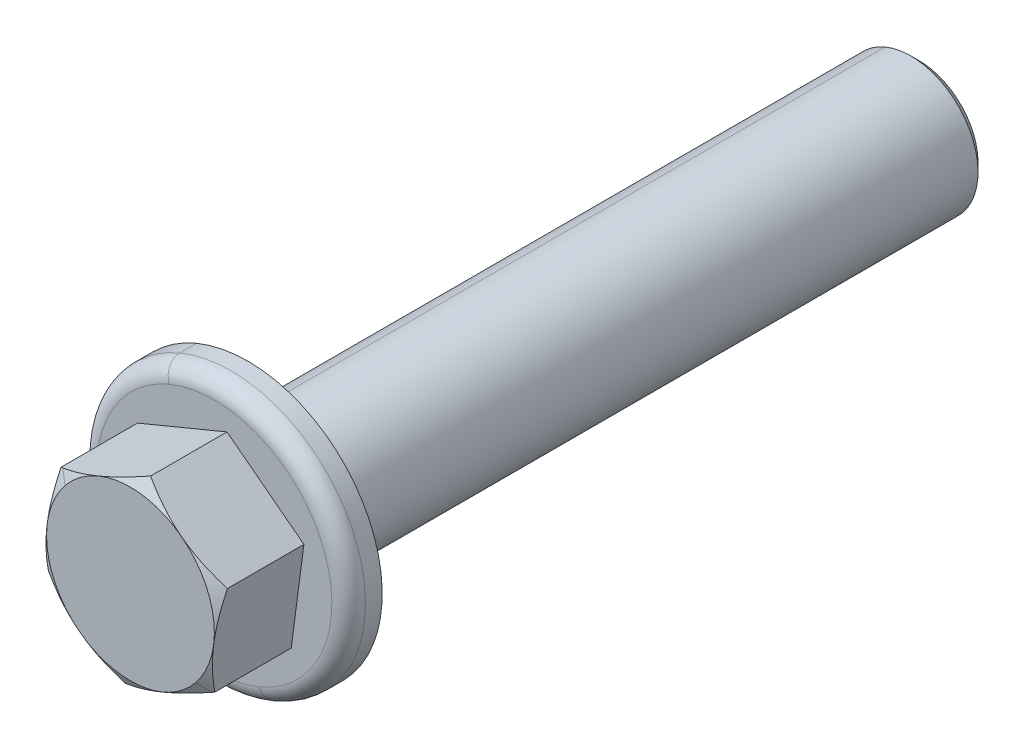
ISO-10303-21;
HEADER;
FILE_DESCRIPTION(('STEP AP214'),'2;1');
FILE_NAME('part.step','',(''),(''),'','','');
FILE_SCHEMA(('AUTOMOTIVE_DESIGN { 1 0 10303 214 1 1 1 1 }'));
ENDSEC;
DATA;
#1=APPLICATION_CONTEXT('core data for automotive mechanical design processes');
#2=APPLICATION_PROTOCOL_DEFINITION('international standard','automotive_design',2000,#1);
#3=PRODUCT_CONTEXT('',#1,'mechanical');
#4=PRODUCT('Part','Part','',(#3));
#5=PRODUCT_RELATED_PRODUCT_CATEGORY('part','',(#4));
#6=PRODUCT_DEFINITION_FORMATION('','',#4);
#7=PRODUCT_DEFINITION_CONTEXT('part definition',#1,'design');
#8=PRODUCT_DEFINITION('design','',#6,#7);
#9=PRODUCT_DEFINITION_SHAPE('','',#8);
#10=(LENGTH_UNIT() NAMED_UNIT(*) SI_UNIT(.MILLI.,.METRE.));
#11=(NAMED_UNIT(*) PLANE_ANGLE_UNIT() SI_UNIT($,.RADIAN.));
#12=(NAMED_UNIT(*) SI_UNIT($,.STERADIAN.) SOLID_ANGLE_UNIT());
#13=UNCERTAINTY_MEASURE_WITH_UNIT(LENGTH_MEASURE(1.E-05),#10,'distance_accuracy_value','');
#14=(GEOMETRIC_REPRESENTATION_CONTEXT(3) GLOBAL_UNCERTAINTY_ASSIGNED_CONTEXT((#13)) GLOBAL_UNIT_ASSIGNED_CONTEXT((#10,
#11,#12)) REPRESENTATION_CONTEXT('',''));
#15=CARTESIAN_POINT('',(0.,0.,0.));
#16=DIRECTION('',(0.,0.,1.));
#17=DIRECTION('',(1.,0.,0.));
#18=AXIS2_PLACEMENT_3D('',#15,#16,#17);
#19=CARTESIAN_POINT('',(75.,-122.,24.3));
#20=DIRECTION('',(0.,0.,1.));
#21=DIRECTION('',(0.923728021347068,0.383049008063238,0.));
#22=AXIS2_PLACEMENT_3D('',#19,#20,#21);
#23=TOROIDAL_SURFACE('',#22,4.25,0.25);
#24=CARTESIAN_POINT('',(75.,-122.,24.55));
#25=DIRECTION('',(0.,0.,-1.));
#26=DIRECTION('',(-0.923728021347068,-0.383049008063239,0.));
#27=AXIS2_PLACEMENT_3D('',#24,#25,#26);
#28=CIRCLE('',#27,4.25);
#29=CARTESIAN_POINT('',(76.6279582842688,-125.925844090725,24.55));
#30=VERTEX_POINT('',#29);
#31=CARTESIAN_POINT('',(73.3720417157312,-118.074155909275,24.55));
#32=VERTEX_POINT('',#31);
#33=EDGE_CURVE('E11',#30,#32,#28,.T.);
#34=ORIENTED_EDGE('',*,*,#33,.T.);
#35=CARTESIAN_POINT('',(73.3720417157312,-118.074155909275,24.3));
#36=DIRECTION('',(0.923728021347068,0.383049008063238,0.));
#37=DIRECTION('',(0.,0.,1.));
#38=AXIS2_PLACEMENT_3D('',#35,#36,#37);
#39=CIRCLE('',#38,0.25);
#40=CARTESIAN_POINT('',(73.4678039677471,-118.305087914612,24.3));
#41=VERTEX_POINT('',#40);
#42=EDGE_CURVE('E33',#32,#41,#39,.T.);
#43=ORIENTED_EDGE('',*,*,#42,.T.);
#44=CARTESIAN_POINT('',(75.,-122.,24.3));
#45=DIRECTION('',(0.,0.,-1.));
#46=DIRECTION('',(-0.923728021347069,-0.383049008063237,0.));
#47=AXIS2_PLACEMENT_3D('',#44,#45,#46);
#48=CIRCLE('',#47,4.);
#49=CARTESIAN_POINT('',(76.532196032253,-125.694912085388,24.3));
#50=VERTEX_POINT('',#49);
#51=EDGE_CURVE('E461',#50,#41,#48,.T.);
#52=ORIENTED_EDGE('',*,*,#51,.F.);
#53=CARTESIAN_POINT('',(76.6279582842688,-125.925844090725,24.3));
#54=DIRECTION('',(-0.923728021347068,-0.383049008063238,0.));
#55=DIRECTION('',(0.,0.,1.));
#56=AXIS2_PLACEMENT_3D('',#53,#54,#55);
#57=CIRCLE('',#56,0.25);
#58=EDGE_CURVE('E457',#30,#50,#57,.T.);
#59=ORIENTED_EDGE('',*,*,#58,.F.);
#60=EDGE_LOOP('',(#34,#43,#52,#59));
#61=FACE_BOUND('',#60,.T.);
#62=ADVANCED_FACE('F17',(#61),#23,.F.);
#63=CARTESIAN_POINT('',(75.,-122.,24.3));
#64=DIRECTION('',(0.,0.,1.));
#65=DIRECTION('',(-0.383049008063239,0.923728021347068,0.));
#66=AXIS2_PLACEMENT_3D('',#63,#64,#65);
#67=TOROIDAL_SURFACE('',#66,4.25,0.25);
#68=CARTESIAN_POINT('',(75.,-122.,24.55));
#69=DIRECTION('',(0.,0.,-1.));
#70=DIRECTION('',(-0.923728021347068,-0.383049008063239,0.));
#71=AXIS2_PLACEMENT_3D('',#68,#69,#70);
#72=CIRCLE('',#71,4.25);
#73=EDGE_CURVE('E454',#32,#30,#72,.T.);
#74=ORIENTED_EDGE('',*,*,#73,.T.);
#75=ORIENTED_EDGE('',*,*,#58,.T.);
#76=CARTESIAN_POINT('',(75.,-122.,24.3));
#77=DIRECTION('',(0.,0.,-1.));
#78=DIRECTION('',(-0.923728021347069,-0.383049008063237,0.));
#79=AXIS2_PLACEMENT_3D('',#76,#77,#78);
#80=CIRCLE('',#79,4.);
#81=EDGE_CURVE('E465',#41,#50,#80,.T.);
#82=ORIENTED_EDGE('',*,*,#81,.F.);
#83=ORIENTED_EDGE('',*,*,#42,.F.);
#84=EDGE_LOOP('',(#74,#75,#82,#83));
#85=FACE_BOUND('',#84,.T.);
#86=ADVANCED_FACE('F311',(#85),#67,.F.);
#87=CARTESIAN_POINT('',(75.,-122.,4.55));
#88=DIRECTION('',(0.,0.,1.));
#89=DIRECTION('',(0.923728021347069,0.383049008063237,0.));
#90=AXIS2_PLACEMENT_3D('',#87,#88,#89);
#91=CYLINDRICAL_SURFACE('',#90,4.);
#92=DIRECTION('',(0.,0.,-1.));
#93=VECTOR('',#92,1.);
#94=CARTESIAN_POINT('',(76.532196032253,-125.694912085388,4.55));
#95=LINE('',#94,#93);
#96=CARTESIAN_POINT('',(76.532196032253,-125.694912085388,-14.95));
#97=VERTEX_POINT('',#96);
#98=EDGE_CURVE('E468',#50,#97,#95,.T.);
#99=ORIENTED_EDGE('',*,*,#98,.F.);
#100=ORIENTED_EDGE('',*,*,#51,.T.);
#101=DIRECTION('',(0.,0.,-1.));
#102=VECTOR('',#101,1.);
#103=CARTESIAN_POINT('',(73.4678039677471,-118.305087914612,4.55));
#104=LINE('',#103,#102);
#105=CARTESIAN_POINT('',(73.4678039677471,-118.305087914612,-14.95));
#106=VERTEX_POINT('',#105);
#107=EDGE_CURVE('E472',#41,#106,#104,.T.);
#108=ORIENTED_EDGE('',*,*,#107,.T.);
#109=CARTESIAN_POINT('',(75.,-122.,-14.95));
#110=DIRECTION('',(0.,0.,1.));
#111=DIRECTION('',(-0.923728021347069,-0.383049008063237,0.));
#112=AXIS2_PLACEMENT_3D('',#109,#110,#111);
#113=CIRCLE('',#112,4.);
#114=EDGE_CURVE('E467',#106,#97,#113,.T.);
#115=ORIENTED_EDGE('',*,*,#114,.T.);
#116=EDGE_LOOP('',(#99,#100,#108,#115));
#117=FACE_BOUND('',#116,.T.);
#118=ADVANCED_FACE('F317',(#117),#91,.T.);
#119=CARTESIAN_POINT('',(75.,-122.,4.55));
#120=DIRECTION('',(0.,0.,1.));
#121=DIRECTION('',(0.923728021347069,0.383049008063237,0.));
#122=AXIS2_PLACEMENT_3D('',#119,#120,#121);
#123=CYLINDRICAL_SURFACE('',#122,4.);
#124=ORIENTED_EDGE('',*,*,#107,.F.);
#125=ORIENTED_EDGE('',*,*,#81,.T.);
#126=ORIENTED_EDGE('',*,*,#98,.T.);
#127=CARTESIAN_POINT('',(75.,-122.,-14.95));
#128=DIRECTION('',(0.,0.,1.));
#129=DIRECTION('',(-0.923728021347069,-0.383049008063237,0.));
#130=AXIS2_PLACEMENT_3D('',#127,#128,#129);
#131=CIRCLE('',#130,4.);
#132=EDGE_CURVE('E471',#97,#106,#131,.T.);
#133=ORIENTED_EDGE('',*,*,#132,.T.);
#134=EDGE_LOOP('',(#124,#125,#126,#133));
#135=FACE_BOUND('',#134,.T.);
#136=ADVANCED_FACE('F322',(#135),#123,.T.);
#137=CARTESIAN_POINT('',(75.,-122.,-18.95));
#138=DIRECTION('',(0.,0.,1.));
#139=DIRECTION('',(-0.114958388351689,0.993370308066223,0.));
#140=AXIS2_PLACEMENT_3D('',#137,#138,#139);
#141=CONICAL_SURFACE('',#140,0.,0.785398163396999);
#142=DIRECTION('',(0.270856393052956,-0.653174413416782,-0.707106781186537));
#143=VECTOR('',#142,1.);
#144=CARTESIAN_POINT('',(73.563567058084,-118.536019572316,-15.2));
#145=LINE('',#144,#143);
#146=CARTESIAN_POINT('',(73.659328713789,-118.766951824929,-15.45));
#147=VERTEX_POINT('',#146);
#148=EDGE_CURVE('E478',#106,#147,#145,.T.);
#149=ORIENTED_EDGE('',*,*,#148,.T.);
#150=CARTESIAN_POINT('',(75.,-122.,-15.45));
#151=DIRECTION('',(0.,0.,1.));
#152=DIRECTION('',(0.993370308066189,0.114958388351984,0.));
#153=AXIS2_PLACEMENT_3D('',#150,#151,#152);
#154=CIRCLE('',#153,3.5);
#155=CARTESIAN_POINT('',(76.3406715282213,-125.233048074715,-15.45));
#156=VERTEX_POINT('',#155);
#157=EDGE_CURVE('E481',#147,#156,#154,.T.);
#158=ORIENTED_EDGE('',*,*,#157,.T.);
#159=DIRECTION('',(-0.270856551128283,0.65317434786655,-0.707106781186547));
#160=VECTOR('',#159,1.);
#161=CARTESIAN_POINT('',(76.4364337802371,-125.463980080051,-15.2));
#162=LINE('',#161,#160);
#163=EDGE_CURVE('E484',#97,#156,#162,.T.);
#164=ORIENTED_EDGE('',*,*,#163,.F.);
#165=ORIENTED_EDGE('',*,*,#114,.F.);
#166=EDGE_LOOP('',(#149,#158,#164,#165));
#167=FACE_BOUND('',#166,.T.);
#168=ADVANCED_FACE('F326',(#167),#141,.T.);
#169=CARTESIAN_POINT('',(75.,-122.,-18.95));
#170=DIRECTION('',(-2.07112037355488E-13,-2.99341000002082E-13,1.));
#171=DIRECTION('',(0.383049008063238,-0.923728021347068,-1.97175609173E-13));
#172=AXIS2_PLACEMENT_3D('',#169,#170,#171);
#173=CONICAL_SURFACE('',#172,0.,0.785398163396999);
#174=ORIENTED_EDGE('',*,*,#163,.T.);
#175=CARTESIAN_POINT('',(75.,-122.,-15.4499999999993));
#176=DIRECTION('',(-2.8263995886347E-13,-1.17204364682804E-13,1.));
#177=DIRECTION('',(0.923728021347068,0.383049008063237,3.05977465587E-13));
#178=AXIS2_PLACEMENT_3D('',#175,#176,#177);
#179=CIRCLE('',#178,3.5);
#180=EDGE_CURVE('E352',#156,#147,#179,.T.);
#181=ORIENTED_EDGE('',*,*,#180,.T.);
#182=ORIENTED_EDGE('',*,*,#148,.F.);
#183=ORIENTED_EDGE('',*,*,#132,.F.);
#184=EDGE_LOOP('',(#174,#181,#182,#183));
#185=FACE_BOUND('',#184,.T.);
#186=ADVANCED_FACE('F330',(#185),#173,.T.);
#187=CARTESIAN_POINT('',(75.,-122.,-15.45));
#188=DIRECTION('',(0.,0.,1.));
#189=DIRECTION('',(-0.383049008063238,0.923728021347068,0.));
#190=AXIS2_PLACEMENT_3D('',#187,#188,#189);
#191=PLANE('',#190);
#192=ORIENTED_EDGE('',*,*,#180,.F.);
#193=ORIENTED_EDGE('',*,*,#157,.F.);
#194=EDGE_LOOP('',(#192,#193));
#195=FACE_BOUND('',#194,.T.);
#196=ADVANCED_FACE('F334',(#195),#191,.F.);
#197=CARTESIAN_POINT('',(75.,-122.,31.55));
#198=DIRECTION('',(0.,0.,1.));
#199=DIRECTION('',(0.923728021347068,0.383049008063238,0.));
#200=AXIS2_PLACEMENT_3D('',#197,#198,#199);
#201=PLANE('',#200);
#202=CARTESIAN_POINT('',(75.,-122.,31.55));
#203=DIRECTION('',(0.,0.,1.));
#204=DIRECTION('',(-0.923728021347068,-0.383049008063239,0.));
#205=AXIS2_PLACEMENT_3D('',#202,#203,#204);
#206=CIRCLE('',#205,5.);
#207=CARTESIAN_POINT('',(79.9574821835296,-122.650669193983,31.5499999999994));
#208=VERTEX_POINT('',#207);
#209=CARTESIAN_POINT('',(78.0422371432125,-118.032029087245,31.5499999999992));
#210=VERTEX_POINT('',#209);
#211=EDGE_CURVE('E347',#208,#210,#206,.T.);
#212=ORIENTED_EDGE('',*,*,#211,.T.);
#213=CARTESIAN_POINT('',(75.,-122.,31.55));
#214=DIRECTION('',(0.,0.,1.));
#215=DIRECTION('',(-0.923728021347068,-0.383049008063239,0.));
#216=AXIS2_PLACEMENT_3D('',#213,#214,#215);
#217=CIRCLE('',#216,5.);
#218=CARTESIAN_POINT('',(73.0847549596836,-117.381359893265,31.55));
#219=VERTEX_POINT('',#218);
#220=EDGE_CURVE('E353',#210,#219,#217,.T.);
#221=ORIENTED_EDGE('',*,*,#220,.T.);
#222=CARTESIAN_POINT('',(75.,-122.,31.55));
#223=DIRECTION('',(0.,0.,1.));
#224=DIRECTION('',(-0.923728021347068,-0.383049008063239,0.));
#225=AXIS2_PLACEMENT_3D('',#222,#223,#224);
#226=CIRCLE('',#225,5.);
#227=CARTESIAN_POINT('',(71.1049203300826,-118.864979367695,31.55));
#228=VERTEX_POINT('',#227);
#229=EDGE_CURVE('E368',#219,#228,#226,.T.);
#230=ORIENTED_EDGE('',*,*,#229,.T.);
#231=CARTESIAN_POINT('',(75.,-122.,31.55));
#232=DIRECTION('',(0.,0.,1.));
#233=DIRECTION('',(-0.923728021347068,-0.383049008063239,0.));
#234=AXIS2_PLACEMENT_3D('',#231,#232,#233);
#235=CIRCLE('',#234,5.);
#236=CARTESIAN_POINT('',(70.0425178164705,-121.349330806017,31.5499999999994));
#237=VERTEX_POINT('',#236);
#238=EDGE_CURVE('E372',#228,#237,#235,.T.);
#239=ORIENTED_EDGE('',*,*,#238,.T.);
#240=CARTESIAN_POINT('',(75.,-122.,31.55));
#241=DIRECTION('',(0.,0.,1.));
#242=DIRECTION('',(-0.923728021347068,-0.383049008063239,0.));
#243=AXIS2_PLACEMENT_3D('',#240,#241,#242);
#244=CIRCLE('',#243,5.);
#245=CARTESIAN_POINT('',(71.9577628567875,-125.967970912755,31.5499999999992));
#246=VERTEX_POINT('',#245);
#247=EDGE_CURVE('E172',#237,#246,#244,.T.);
#248=ORIENTED_EDGE('',*,*,#247,.T.);
#249=CARTESIAN_POINT('',(75.,-122.,31.55));
#250=DIRECTION('',(0.,0.,1.));
#251=DIRECTION('',(-0.923728021347068,-0.383049008063239,0.));
#252=AXIS2_PLACEMENT_3D('',#249,#250,#251);
#253=CIRCLE('',#252,5.);
#254=CARTESIAN_POINT('',(76.9152450403164,-126.618640106735,31.55));
#255=VERTEX_POINT('',#254);
#256=EDGE_CURVE('E147',#246,#255,#253,.T.);
#257=ORIENTED_EDGE('',*,*,#256,.T.);
#258=CARTESIAN_POINT('',(75.,-122.,31.55));
#259=DIRECTION('',(0.,0.,1.));
#260=DIRECTION('',(-0.923728021347068,-0.383049008063239,0.));
#261=AXIS2_PLACEMENT_3D('',#258,#259,#260);
#262=CIRCLE('',#261,5.);
#263=CARTESIAN_POINT('',(78.8950796699174,-125.135020632304,31.55));
#264=VERTEX_POINT('',#263);
#265=EDGE_CURVE('E160',#255,#264,#262,.T.);
#266=ORIENTED_EDGE('',*,*,#265,.T.);
#267=CARTESIAN_POINT('',(75.,-122.,31.55));
#268=DIRECTION('',(0.,0.,1.));
#269=DIRECTION('',(-0.923728021347068,-0.383049008063239,0.));
#270=AXIS2_PLACEMENT_3D('',#267,#268,#269);
#271=CIRCLE('',#270,5.);
#272=EDGE_CURVE('E166',#264,#208,#271,.T.);
#273=ORIENTED_EDGE('',*,*,#272,.T.);
#274=EDGE_LOOP('',(#212,#221,#230,#239,#248,#257,#266,#273));
#275=FACE_BOUND('',#274,.T.);
#276=ADVANCED_FACE('F169',(#275),#201,.T.);
#277=CARTESIAN_POINT('',(75.,-122.,31.55));
#278=DIRECTION('',(0.,0.,-1.));
#279=DIRECTION('',(0.779015933983816,-0.62700412646116,0.));
#280=AXIS2_PLACEMENT_3D('',#277,#278,#279);
#281=CONICAL_SURFACE('',#280,5.,1.0471975512);
#282=ORIENTED_EDGE('',*,*,#211,.F.);
#283=CARTESIAN_POINT('',(80.3331462178307,-119.788465520815,31.1034180126158));
#284=CARTESIAN_POINT('',(80.3025673254997,-120.021447680298,31.1712680083952));
#285=CARTESIAN_POINT('',(80.2717435464103,-120.256295644637,31.2334304503108));
#286=CARTESIAN_POINT('',(80.2098242796661,-120.728061734902,31.3430527974049));
#287=CARTESIAN_POINT('',(80.1787309518113,-120.964963405202,31.3905854034299));
#288=CARTESIAN_POINT('',(80.1317975144758,-121.322551687472,31.4489473736348));
#289=CARTESIAN_POINT('',(80.1160937483892,-121.442199492084,31.4662522919643));
#290=CARTESIAN_POINT('',(80.0846110358865,-121.682067904119,31.4962074663217));
#291=CARTESIAN_POINT('',(80.0688320914603,-121.802288496382,31.5088578448605));
#292=CARTESIAN_POINT('',(80.0371406579159,-122.043747164812,31.5292816727015));
#293=CARTESIAN_POINT('',(80.0212278960404,-122.16498731913,31.537030320741));
#294=CARTESIAN_POINT('',(79.9893710770405,-122.407706067883,31.5474002095299));
#295=CARTESIAN_POINT('',(79.9734270143439,-122.529184704773,31.5500204348124));
#296=CARTESIAN_POINT('',(79.9574821835307,-122.650669193983,31.5499999999987));
#297=B_SPLINE_CURVE_WITH_KNOTS('',3,(#283,#284,#285,#286,#287,#288,#289,#290,#291,#292,#293,
#294,#295,#296),.UNSPECIFIED.,.F.,.F.,(4,2,2,2,2,2,4),(0.,0.734036658391753,1.46436443241733,
1.83000749078415,2.19564092445913,2.56310985866784,2.93065154716874),.UNSPECIFIED.);
#298=CARTESIAN_POINT('',(80.3331462178312,-119.788465520817,31.1034180126158));
#299=VERTEX_POINT('',#298);
#300=EDGE_CURVE('E218',#299,#208,#297,.T.);
#301=ORIENTED_EDGE('',*,*,#300,.F.);
#302=CARTESIAN_POINT('',(78.0422371432134,-118.032029087244,31.5499999999983));
#303=CARTESIAN_POINT('',(78.1394733816286,-118.106579960392,31.550020434812));
#304=CARTESIAN_POINT('',(78.2367049358445,-118.181127242172,31.5474002095295));
#305=CARTESIAN_POINT('',(78.4309771287393,-118.330075431086,31.5370303207407));
#306=CARTESIAN_POINT('',(78.5280178013998,-118.404476364273,31.5292816727012));
#307=CARTESIAN_POINT('',(78.7212814254514,-118.55265128502,31.5088578448602));
#308=CARTESIAN_POINT('',(78.8175060401959,-118.626426547869,31.4962074663214));
#309=CARTESIAN_POINT('',(79.0094968223327,-118.773625582694,31.4662522919641));
#310=CARTESIAN_POINT('',(79.1052629775904,-118.847049345366,31.4489473736346));
#311=CARTESIAN_POINT('',(79.3914767954643,-119.06648903552,31.3905854034297));
#312=CARTESIAN_POINT('',(79.5810929962152,-119.21186748248,31.3430527974047));
#313=CARTESIAN_POINT('',(79.9586947816568,-119.501374185597,31.2334304503107));
#314=CARTESIAN_POINT('',(80.1466671952567,-119.645492343498,31.1712680083951));
#315=CARTESIAN_POINT('',(80.3331462178316,-119.788465520818,31.1034180126157));
#316=B_SPLINE_CURVE_WITH_KNOTS('',3,(#302,#303,#304,#305,#306,#307,#308,#309,#310,#311,#312,
#313,#314,#315),.UNSPECIFIED.,.F.,.F.,(4,2,2,2,2,2,4),(0.,0.367541688500733,0.735010622709294,
1.10064405638409,1.46628711475075,2.19661488877598,2.93065154716739),.UNSPECIFIED.);
#317=EDGE_CURVE('E234',#210,#299,#316,.T.);
#318=ORIENTED_EDGE('',*,*,#317,.F.);
#319=EDGE_LOOP('',(#282,#301,#318));
#320=FACE_BOUND('',#319,.T.);
#321=ADVANCED_FACE('F248',(#320),#281,.T.);
#322=CARTESIAN_POINT('',(75.,-122.,31.55));
#323=DIRECTION('',(0.,0.,-1.));
#324=DIRECTION('',(0.779015933983816,-0.62700412646116,0.));
#325=AXIS2_PLACEMENT_3D('',#322,#323,#324);
#326=CONICAL_SURFACE('',#325,5.,1.0471975512);
#327=ORIENTED_EDGE('',*,*,#220,.F.);
#328=CARTESIAN_POINT('',(75.7513280685985,-116.275592653672,31.1034180126171));
#329=CARTESIAN_POINT('',(75.9378070911732,-116.418565830991,31.1712680083963));
#330=CARTESIAN_POINT('',(76.1257795047728,-116.562683988892,31.2334304503117));
#331=CARTESIAN_POINT('',(76.5033812902139,-116.852190692008,31.3430527974054));
#332=CARTESIAN_POINT('',(76.6929974909645,-116.997569138968,31.3905854034302));
#333=CARTESIAN_POINT('',(76.9792113088379,-117.217008829122,31.4489473736349));
#334=CARTESIAN_POINT('',(77.0749774640956,-117.290432591794,31.4662522919643));
#335=CARTESIAN_POINT('',(77.2669682462321,-117.437631626619,31.4962074663216));
#336=CARTESIAN_POINT('',(77.3631928609764,-117.511406889468,31.5088578448604));
#337=CARTESIAN_POINT('',(77.5564564850278,-117.659581810214,31.5292816727013));
#338=CARTESIAN_POINT('',(77.6534971576881,-117.733982743402,31.5370303207408));
#339=CARTESIAN_POINT('',(77.8477693505826,-117.882930932316,31.5474002095296));
#340=CARTESIAN_POINT('',(77.9450009047984,-117.957478214095,31.550020434812));
#341=CARTESIAN_POINT('',(78.0422371432134,-118.032029087244,31.5499999999983));
#342=B_SPLINE_CURVE_WITH_KNOTS('',3,(#328,#329,#330,#331,#332,#333,#334,#335,#336,#337,#338,
#339,#340,#341),.UNSPECIFIED.,.F.,.F.,(4,2,2,2,2,2,4),(0.,0.734036658390346,1.46436443241451,
1.8300074907806,2.19564092445488,2.56310985866291,2.93065154716311),.UNSPECIFIED.);
#343=CARTESIAN_POINT('',(75.7513280685995,-116.275592653672,31.1034180126172));
#344=VERTEX_POINT('',#343);
#345=EDGE_CURVE('E225',#344,#210,#342,.T.);
#346=ORIENTED_EDGE('',*,*,#345,.F.);
#347=CARTESIAN_POINT('',(73.0847549596836,-117.381359893264,31.55));
#348=CARTESIAN_POINT('',(73.197936028912,-117.334426277203,31.5500204348136));
#349=CARTESIAN_POINT('',(73.3111116458244,-117.287494922092,31.5474002095311));
#350=CARTESIAN_POINT('',(73.537240657719,-117.193724362253,31.5370303207422));
#351=CARTESIAN_POINT('',(73.6501940922549,-117.146885141123,31.5292816727027));
#352=CARTESIAN_POINT('',(73.8751491498509,-117.05360139344,31.5088578448617));
#353=CARTESIAN_POINT('',(73.9871527090215,-117.007156064027,31.4962074663229));
#354=CARTESIAN_POINT('',(74.2106262036608,-116.914486686816,31.4662522919655));
#355=CARTESIAN_POINT('',(74.3220961250052,-116.868262644876,31.4489473736361));
#356=CARTESIAN_POINT('',(74.6552433802143,-116.730114052761,31.3905854034312));
#357=CARTESIAN_POINT('',(74.87595290882,-116.638590829421,31.3430527974062));
#358=CARTESIAN_POINT('',(75.3154739610055,-116.456331442273,31.2334304503122));
#359=CARTESIAN_POINT('',(75.5342701536947,-116.365601635835,31.1712680083966));
#360=CARTESIAN_POINT('',(75.7513280686005,-116.275592653672,31.1034180126172));
#361=B_SPLINE_CURVE_WITH_KNOTS('',3,(#347,#348,#349,#350,#351,#352,#353,#354,#355,#356,#357,
#358,#359,#360),.UNSPECIFIED.,.F.,.F.,(4,2,2,2,2,2,4),(0.,0.367541688500738,0.73501062270928,
1.10064405638409,1.46628711475069,2.19661488877591,2.93065154716731),.UNSPECIFIED.);
#362=EDGE_CURVE('E256',#219,#344,#361,.T.);
#363=ORIENTED_EDGE('',*,*,#362,.F.);
#364=EDGE_LOOP('',(#327,#346,#363));
#365=FACE_BOUND('',#364,.T.);
#366=ADVANCED_FACE('F243',(#365),#326,.T.);
#367=CARTESIAN_POINT('',(75.,-122.,31.55));
#368=DIRECTION('',(0.,0.,-1.));
#369=DIRECTION('',(0.779015933983816,-0.62700412646116,0.));
#370=AXIS2_PLACEMENT_3D('',#367,#368,#369);
#371=CONICAL_SURFACE('',#370,5.,1.0471975512);
#372=DIRECTION('',(0.674647588782705,-0.543001501793055,0.500000000000169));
#373=VECTOR('',#372,1.);
#374=CARTESIAN_POINT('',(69.3669224154155,-117.466122403752,30.2619216436));
#375=LINE('',#374,#373);
#376=CARTESIAN_POINT('',(70.56158036968,-118.427663027451,31.1473157175631));
#377=VERTEX_POINT('',#376);
#378=EDGE_CURVE('E359',#377,#228,#375,.T.);
#379=ORIENTED_EDGE('',*,*,#378,.T.);
#380=ORIENTED_EDGE('',*,*,#229,.F.);
#381=CARTESIAN_POINT('',(70.5615803696752,-118.427663027445,31.1473157175507));
#382=CARTESIAN_POINT('',(70.7673217148021,-118.342346769475,31.2089939702821));
#383=CARTESIAN_POINT('',(70.9746224299532,-118.256383876207,31.2652901400361));
#384=CARTESIAN_POINT('',(71.3909329073831,-118.083749386682,31.3643275190329));
#385=CARTESIAN_POINT('',(71.5999301967077,-117.997082962677,31.4071306974176));
#386=CARTESIAN_POINT('',(71.915212095264,-117.866342727768,31.4595623012599));
#387=CARTESIAN_POINT('',(72.0206626289596,-117.822614789026,31.4750826376559));
#388=CARTESIAN_POINT('',(72.2320204272281,-117.734969515631,31.5019229351793));
#389=CARTESIAN_POINT('',(72.3379276831069,-117.691052184584,31.5132429759077));
#390=CARTESIAN_POINT('',(72.5505601436129,-117.602878337741,31.5315033490442));
#391=CARTESIAN_POINT('',(72.6572868640019,-117.558621193393,31.538423132808));
#392=CARTESIAN_POINT('',(72.8709259752326,-117.470029911383,31.547679987982));
#393=CARTESIAN_POINT('',(72.9778383927836,-117.425695762644,31.5500163340105));
#394=CARTESIAN_POINT('',(73.0847549596836,-117.381359893264,31.55));
#395=B_SPLINE_CURVE_WITH_KNOTS('',3,(#381,#382,#383,#384,#385,#386,#387,#388,#389,#390,#391,
#392,#393,#394),.UNSPECIFIED.,.F.,.F.,(4,2,2,2,2,2,4),(0.,0.693572709724988,1.38391201165236,
1.72946469135563,2.07501082206922,2.42215898329276,2.76936208027046),.UNSPECIFIED.);
#396=EDGE_CURVE('E262',#377,#219,#395,.T.);
#397=ORIENTED_EDGE('',*,*,#396,.F.);
#398=EDGE_LOOP('',(#379,#380,#397));
#399=FACE_BOUND('',#398,.T.);
#400=ADVANCED_FACE('F247',(#399),#371,.T.);
#401=CARTESIAN_POINT('',(75.,-122.,31.55));
#402=DIRECTION('',(0.,0.,-1.));
#403=DIRECTION('',(0.779015933983816,-0.62700412646116,0.));
#404=AXIS2_PLACEMENT_3D('',#401,#402,#403);
#405=CONICAL_SURFACE('',#404,5.,1.0471975512);
#406=ORIENTED_EDGE('',*,*,#238,.F.);
#407=ORIENTED_EDGE('',*,*,#378,.F.);
#408=CARTESIAN_POINT('',(70.5615803696809,-118.427663027451,31.1473157175));
#409=CARTESIAN_POINT('',(70.5144006273216,-118.447227393903,31.1331782382));
#410=CARTESIAN_POINT('',(70.466617991441,-118.46704176659,31.1185548376));
#411=CARTESIAN_POINT('',(70.4181818507684,-118.487127132856,31.1034180126));
#412=B_SPLINE_CURVE_WITH_KNOTS('',3,(#408,#409,#410,#411),.UNSPECIFIED.,.F.,.F.,(4,4),(0.,1.),.UNSPECIFIED.);
#413=CARTESIAN_POINT('',(70.4181818507687,-118.487127132854,31.1034180126083));
#414=VERTEX_POINT('',#413);
#415=EDGE_CURVE('E362',#377,#414,#412,.T.);
#416=ORIENTED_EDGE('',*,*,#415,.T.);
#417=CARTESIAN_POINT('',(70.0425178164693,-121.349330806017,31.5499999999987));
#418=CARTESIAN_POINT('',(70.0584626472825,-121.227846316807,31.5500204348124));
#419=CARTESIAN_POINT('',(70.0744067099791,-121.106367679917,31.5474002095299));
#420=CARTESIAN_POINT('',(70.1062635289789,-120.863648931164,31.5370303207411));
#421=CARTESIAN_POINT('',(70.1221762908544,-120.742408776846,31.5292816727016));
#422=CARTESIAN_POINT('',(70.1538677243988,-120.500950108417,31.5088578448606));
#423=CARTESIAN_POINT('',(70.169646668825,-120.380729516154,31.4962074663217));
#424=CARTESIAN_POINT('',(70.2011293813276,-120.140861104119,31.4662522919645));
#425=CARTESIAN_POINT('',(70.2168331474142,-120.021213299507,31.448947373635));
#426=CARTESIAN_POINT('',(70.2637665847497,-119.663625017237,31.3905854034302));
#427=CARTESIAN_POINT('',(70.2948599126045,-119.426723346938,31.3430527974052));
#428=CARTESIAN_POINT('',(70.3567791793486,-118.954957256673,31.2334304503113));
#429=CARTESIAN_POINT('',(70.387602958438,-118.720109292334,31.1712680083958));
#430=CARTESIAN_POINT('',(70.418181850769,-118.487127132852,31.1034180126165));
#431=B_SPLINE_CURVE_WITH_KNOTS('',3,(#417,#418,#419,#420,#421,#422,#423,#424,#425,#426,#427,
#428,#429,#430),.UNSPECIFIED.,.F.,.F.,(4,2,2,2,2,2,4),(0.,0.367541688500591,0.735010622708997,
1.10064405638367,1.46628711475016,2.19661488877509,2.93065154716624),.UNSPECIFIED.);
#432=EDGE_CURVE('E287',#237,#414,#431,.T.);
#433=ORIENTED_EDGE('',*,*,#432,.F.);
#434=EDGE_LOOP('',(#406,#407,#416,#433));
#435=FACE_BOUND('',#434,.T.);
#436=ADVANCED_FACE('F297',(#435),#405,.T.);
#437=CARTESIAN_POINT('',(75.,-122.,31.55));
#438=DIRECTION('',(0.,0.,-1.));
#439=DIRECTION('',(0.779015933983816,-0.62700412646116,0.));
#440=AXIS2_PLACEMENT_3D('',#437,#438,#439);
#441=CONICAL_SURFACE('',#440,5.,1.0471975512);
#442=ORIENTED_EDGE('',*,*,#247,.F.);
#443=CARTESIAN_POINT('',(69.6668537821693,-124.211534479184,31.1034180126158));
#444=CARTESIAN_POINT('',(69.6974326745003,-123.978552319702,31.1712680083952));
#445=CARTESIAN_POINT('',(69.7282564535898,-123.743704355363,31.2334304503109));
#446=CARTESIAN_POINT('',(69.7901757203339,-123.271938265098,31.3430527974049));
#447=CARTESIAN_POINT('',(69.8212690481887,-123.035036594798,31.39058540343));
#448=CARTESIAN_POINT('',(69.8682024855242,-122.677448312528,31.4489473736349));
#449=CARTESIAN_POINT('',(69.8839062516109,-122.557800507916,31.4662522919643));
#450=CARTESIAN_POINT('',(69.9153889641135,-122.317932095881,31.4962074663217));
#451=CARTESIAN_POINT('',(69.9311679085397,-122.197711503618,31.5088578448605));
#452=CARTESIAN_POINT('',(69.9628593420842,-121.956252835188,31.5292816727015));
#453=CARTESIAN_POINT('',(69.9787721039597,-121.83501268087,31.5370303207411));
#454=CARTESIAN_POINT('',(70.0106289229595,-121.592293932117,31.5474002095299));
#455=CARTESIAN_POINT('',(70.0265729856561,-121.470815295227,31.5500204348124));
#456=CARTESIAN_POINT('',(70.0425178164693,-121.349330806017,31.5499999999987));
#457=B_SPLINE_CURVE_WITH_KNOTS('',3,(#443,#444,#445,#446,#447,#448,#449,#450,#451,#452,#453,
#454,#455,#456),.UNSPECIFIED.,.F.,.F.,(4,2,2,2,2,2,4),(0.,0.734036658391716,1.46436443241723,
1.830007490784,2.19564092445897,2.5631098586677,2.93065154716856),.UNSPECIFIED.);
#458=CARTESIAN_POINT('',(69.6668537821689,-124.211534479183,31.1034180126158));
#459=VERTEX_POINT('',#458);
#460=EDGE_CURVE('E268',#459,#237,#457,.T.);
#461=ORIENTED_EDGE('',*,*,#460,.F.);
#462=CARTESIAN_POINT('',(71.9577628567866,-125.967970912756,31.5499999999984));
#463=CARTESIAN_POINT('',(71.8605266183715,-125.893420039608,31.5500204348121));
#464=CARTESIAN_POINT('',(71.7632950641555,-125.818872757828,31.5474002095296));
#465=CARTESIAN_POINT('',(71.5690228712607,-125.669924568914,31.5370303207408));
#466=CARTESIAN_POINT('',(71.4719821986002,-125.595523635727,31.5292816727012));
#467=CARTESIAN_POINT('',(71.2787185745486,-125.44734871498,31.5088578448602));
#468=CARTESIAN_POINT('',(71.1824939598041,-125.373573452131,31.4962074663214));
#469=CARTESIAN_POINT('',(70.9905031776673,-125.226374417306,31.4662522919641));
#470=CARTESIAN_POINT('',(70.8947370224095,-125.152950654634,31.4489473736346));
#471=CARTESIAN_POINT('',(70.6085232045357,-124.93351096448,31.3905854034297));
#472=CARTESIAN_POINT('',(70.4189070037848,-124.78813251752,31.3430527974047));
#473=CARTESIAN_POINT('',(70.0413052183432,-124.498625814403,31.2334304503107));
#474=CARTESIAN_POINT('',(69.8533328047433,-124.354507656502,31.1712680083952));
#475=CARTESIAN_POINT('',(69.6668537821684,-124.211534479182,31.1034180126158));
#476=B_SPLINE_CURVE_WITH_KNOTS('',3,(#462,#463,#464,#465,#466,#467,#468,#469,#470,#471,#472,
#473,#474,#475),.UNSPECIFIED.,.F.,.F.,(4,2,2,2,2,2,4),(0.,0.367541688500761,0.735010622709334,
1.10064405638422,1.46628711475081,2.19661488877607,2.93065154716752),.UNSPECIFIED.);
#477=EDGE_CURVE('E188',#246,#459,#476,.T.);
#478=ORIENTED_EDGE('',*,*,#477,.F.);
#479=EDGE_LOOP('',(#442,#461,#478));
#480=FACE_BOUND('',#479,.T.);
#481=ADVANCED_FACE('F300',(#480),#441,.T.);
#482=CARTESIAN_POINT('',(75.,-122.,31.55));
#483=DIRECTION('',(0.,0.,-1.));
#484=DIRECTION('',(0.779015933983816,-0.62700412646116,0.));
#485=AXIS2_PLACEMENT_3D('',#482,#483,#484);
#486=CONICAL_SURFACE('',#485,5.,1.0471975512);
#487=ORIENTED_EDGE('',*,*,#256,.F.);
#488=CARTESIAN_POINT('',(74.2486719314015,-127.724407346328,31.1034180126172));
#489=CARTESIAN_POINT('',(74.0621929088269,-127.581434169009,31.1712680083963));
#490=CARTESIAN_POINT('',(73.8742204952273,-127.437316011108,31.2334304503117));
#491=CARTESIAN_POINT('',(73.4966187097862,-127.147809307992,31.3430527974054));
#492=CARTESIAN_POINT('',(73.3070025090355,-127.002430861032,31.3905854034303));
#493=CARTESIAN_POINT('',(73.0207886911621,-126.782991170878,31.448947373635));
#494=CARTESIAN_POINT('',(72.9250225359045,-126.709567408206,31.4662522919644));
#495=CARTESIAN_POINT('',(72.733031753768,-126.562368373381,31.4962074663216));
#496=CARTESIAN_POINT('',(72.6368071390236,-126.488593110532,31.5088578448604));
#497=CARTESIAN_POINT('',(72.4435435149723,-126.340418189786,31.5292816727013));
#498=CARTESIAN_POINT('',(72.3465028423119,-126.266017256598,31.5370303207408));
#499=CARTESIAN_POINT('',(72.1522306494174,-126.117069067684,31.5474002095296));
#500=CARTESIAN_POINT('',(72.0549990952017,-126.042521785905,31.5500204348121));
#501=CARTESIAN_POINT('',(71.9577628567866,-125.967970912756,31.5499999999984));
#502=B_SPLINE_CURVE_WITH_KNOTS('',3,(#488,#489,#490,#491,#492,#493,#494,#495,#496,#497,#498,
#499,#500,#501),.UNSPECIFIED.,.F.,.F.,(4,2,2,2,2,2,4),(0.,0.734036658390324,1.4643644324145,
1.83000749078061,2.19564092445488,2.5631098586629,2.93065154716311),.UNSPECIFIED.);
#503=CARTESIAN_POINT('',(74.2486719314005,-127.724407346328,31.1034180126172));
#504=VERTEX_POINT('',#503);
#505=EDGE_CURVE('E150',#504,#246,#502,.T.);
#506=ORIENTED_EDGE('',*,*,#505,.F.);
#507=CARTESIAN_POINT('',(76.9152450403164,-126.618640106736,31.55));
#508=CARTESIAN_POINT('',(76.8020639710881,-126.665573722797,31.5500204348136));
#509=CARTESIAN_POINT('',(76.6888883541756,-126.712505077908,31.5474002095311));
#510=CARTESIAN_POINT('',(76.4627593422811,-126.806275637747,31.5370303207422));
#511=CARTESIAN_POINT('',(76.3498059077452,-126.853114858877,31.5292816727027));
#512=CARTESIAN_POINT('',(76.1248508501492,-126.94639860656,31.5088578448617));
#513=CARTESIAN_POINT('',(76.0128472909786,-126.992843935973,31.4962074663229));
#514=CARTESIAN_POINT('',(75.7893737963392,-127.085513313184,31.4662522919655));
#515=CARTESIAN_POINT('',(75.6779038749949,-127.131737355124,31.4489473736361));
#516=CARTESIAN_POINT('',(75.3447566197857,-127.269885947239,31.3905854034312));
#517=CARTESIAN_POINT('',(75.1240470911801,-127.361409170579,31.3430527974062));
#518=CARTESIAN_POINT('',(74.6845260389945,-127.543668557727,31.2334304503122));
#519=CARTESIAN_POINT('',(74.4657298463053,-127.634398364164,31.1712680083966));
#520=CARTESIAN_POINT('',(74.2486719313995,-127.724407346327,31.1034180126172));
#521=B_SPLINE_CURVE_WITH_KNOTS('',3,(#507,#508,#509,#510,#511,#512,#513,#514,#515,#516,#517,
#518,#519,#520),.UNSPECIFIED.,.F.,.F.,(4,2,2,2,2,2,4),(0.,0.367541688500714,0.735010622709239,
1.10064405638404,1.46628711475064,2.19661488877585,2.93065154716724),.UNSPECIFIED.);
#522=EDGE_CURVE('E21',#255,#504,#521,.T.);
#523=ORIENTED_EDGE('',*,*,#522,.F.);
#524=EDGE_LOOP('',(#487,#506,#523));
#525=FACE_BOUND('',#524,.T.);
#526=ADVANCED_FACE('F145',(#525),#486,.T.);
#527=CARTESIAN_POINT('',(75.,-122.,31.55));
#528=DIRECTION('',(0.,0.,-1.));
#529=DIRECTION('',(0.779015933983816,-0.62700412646116,0.));
#530=AXIS2_PLACEMENT_3D('',#527,#528,#529);
#531=CONICAL_SURFACE('',#530,5.,1.0471975512);
#532=DIRECTION('',(-0.674647588782705,0.543001501793055,0.500000000000169));
#533=VECTOR('',#532,1.);
#534=CARTESIAN_POINT('',(80.6330775845845,-126.533877596248,30.2619216436));
#535=LINE('',#534,#533);
#536=CARTESIAN_POINT('',(79.43841963032,-125.572336972549,31.1473157175631));
#537=VERTEX_POINT('',#536);
#538=EDGE_CURVE('E163',#537,#264,#535,.T.);
#539=ORIENTED_EDGE('',*,*,#538,.T.);
#540=ORIENTED_EDGE('',*,*,#265,.F.);
#541=CARTESIAN_POINT('',(79.4384196303248,-125.572336972555,31.1473157175507));
#542=CARTESIAN_POINT('',(79.2326782851979,-125.657653230525,31.2089939702821));
#543=CARTESIAN_POINT('',(79.0253775700468,-125.743616123793,31.2652901400361));
#544=CARTESIAN_POINT('',(78.6090670926169,-125.916250613318,31.3643275190329));
#545=CARTESIAN_POINT('',(78.4000698032923,-126.002917037323,31.4071306974176));
#546=CARTESIAN_POINT('',(78.084787904736,-126.133657272232,31.4595623012599));
#547=CARTESIAN_POINT('',(77.9793373710404,-126.177385210974,31.4750826376559));
#548=CARTESIAN_POINT('',(77.7679795727719,-126.265030484369,31.5019229351793));
#549=CARTESIAN_POINT('',(77.6620723168931,-126.308947815416,31.5132429759077));
#550=CARTESIAN_POINT('',(77.4494398563871,-126.397121662259,31.5315033490442));
#551=CARTESIAN_POINT('',(77.3427131359981,-126.441378806607,31.538423132808));
#552=CARTESIAN_POINT('',(77.1290740247674,-126.529970088617,31.547679987982));
#553=CARTESIAN_POINT('',(77.0221616072163,-126.574304237356,31.5500163340105));
#554=CARTESIAN_POINT('',(76.9152450403164,-126.618640106736,31.55));
#555=B_SPLINE_CURVE_WITH_KNOTS('',3,(#541,#542,#543,#544,#545,#546,#547,#548,#549,#550,#551,
#552,#553,#554),.UNSPECIFIED.,.F.,.F.,(4,2,2,2,2,2,4),(0.,0.693572709724986,1.38391201165235,
1.7294646913556,2.07501082206922,2.42215898329275,2.76936208027046),.UNSPECIFIED.);
#556=EDGE_CURVE('E155',#537,#255,#555,.T.);
#557=ORIENTED_EDGE('',*,*,#556,.F.);
#558=EDGE_LOOP('',(#539,#540,#557));
#559=FACE_BOUND('',#558,.T.);
#560=ADVANCED_FACE('F161',(#559),#531,.T.);
#561=CARTESIAN_POINT('',(75.,-122.,31.55));
#562=DIRECTION('',(0.,0.,-1.));
#563=DIRECTION('',(0.779015933983816,-0.62700412646116,0.));
#564=AXIS2_PLACEMENT_3D('',#561,#562,#563);
#565=CONICAL_SURFACE('',#564,5.,1.0471975512);
#566=ORIENTED_EDGE('',*,*,#272,.F.);
#567=ORIENTED_EDGE('',*,*,#538,.F.);
#568=CARTESIAN_POINT('',(79.4384196303191,-125.572336972549,31.1473157175));
#569=CARTESIAN_POINT('',(79.4855993726784,-125.552772606097,31.1331782382));
#570=CARTESIAN_POINT('',(79.533382008559,-125.53295823341,31.1185548376));
#571=CARTESIAN_POINT('',(79.5818181492316,-125.512872867144,31.1034180126));
#572=B_SPLINE_CURVE_WITH_KNOTS('',3,(#568,#569,#570,#571),.UNSPECIFIED.,.F.,.F.,(4,4),(0.,1.),.UNSPECIFIED.);
#573=CARTESIAN_POINT('',(79.5818181492313,-125.512872867146,31.1034180126083));
#574=VERTEX_POINT('',#573);
#575=EDGE_CURVE('E178',#537,#574,#572,.T.);
#576=ORIENTED_EDGE('',*,*,#575,.T.);
#577=CARTESIAN_POINT('',(79.9574821835307,-122.650669193983,31.5499999999987));
#578=CARTESIAN_POINT('',(79.9415373527175,-122.772153683193,31.5500204348124));
#579=CARTESIAN_POINT('',(79.9255932900209,-122.893632320084,31.5474002095299));
#580=CARTESIAN_POINT('',(79.8937364710211,-123.136351068836,31.5370303207411));
#581=CARTESIAN_POINT('',(79.8778237091456,-123.257591223154,31.5292816727015));
#582=CARTESIAN_POINT('',(79.8461322756012,-123.499049891583,31.5088578448606));
#583=CARTESIAN_POINT('',(79.830353331175,-123.619270483846,31.4962074663217));
#584=CARTESIAN_POINT('',(79.7988706186724,-123.859138895881,31.4662522919644));
#585=CARTESIAN_POINT('',(79.7831668525858,-123.978786700493,31.448947373635));
#586=CARTESIAN_POINT('',(79.7362334152503,-124.336374982763,31.3905854034302));
#587=CARTESIAN_POINT('',(79.7051400873955,-124.573276653063,31.3430527974052));
#588=CARTESIAN_POINT('',(79.6432208206514,-125.045042743327,31.2334304503113));
#589=CARTESIAN_POINT('',(79.612397041562,-125.279890707666,31.1712680083958));
#590=CARTESIAN_POINT('',(79.581818149231,-125.512872867148,31.1034180126165));
#591=B_SPLINE_CURVE_WITH_KNOTS('',3,(#577,#578,#579,#580,#581,#582,#583,#584,#585,#586,#587,
#588,#589,#590),.UNSPECIFIED.,.F.,.F.,(4,2,2,2,2,2,4),(0.,0.367541688500564,0.735010622708957,
1.10064405638362,1.46628711475007,2.19661488877497,2.93065154716604),.UNSPECIFIED.);
#592=EDGE_CURVE('E211',#208,#574,#591,.T.);
#593=ORIENTED_EDGE('',*,*,#592,.F.);
#594=EDGE_LOOP('',(#566,#567,#576,#593));
#595=FACE_BOUND('',#594,.T.);
#596=ADVANCED_FACE('F201',(#595),#565,.T.);
#597=CARTESIAN_POINT('',(79.5818181492316,-125.512872867144,24.55));
#598=DIRECTION('',(0.991496436705686,-0.130133838796557,0.));
#599=DIRECTION('',(-0.130133838796557,-0.991496436705686,0.));
#600=AXIS2_PLACEMENT_3D('',#597,#598,#599);
#601=PLANE('',#600);
#602=DIRECTION('',(0.,0.,1.));
#603=VECTOR('',#602,1.);
#604=CARTESIAN_POINT('',(80.3331462178308,-119.788465520817,28.8267090063));
#605=LINE('',#604,#603);
#606=CARTESIAN_POINT('',(80.3331462178308,-119.788465520817,26.55));
#607=VERTEX_POINT('',#606);
#608=EDGE_CURVE('E358',#607,#299,#605,.T.);
#609=ORIENTED_EDGE('',*,*,#608,.T.);
#610=ORIENTED_EDGE('',*,*,#300,.T.);
#611=ORIENTED_EDGE('',*,*,#592,.T.);
#612=DIRECTION('',(0.,0.,1.));
#613=VECTOR('',#612,1.);
#614=CARTESIAN_POINT('',(79.5818181492316,-125.512872867144,28.8267090063));
#615=LINE('',#614,#613);
#616=CARTESIAN_POINT('',(79.5818181492316,-125.512872867144,26.55));
#617=VERTEX_POINT('',#616);
#618=EDGE_CURVE('E179',#617,#574,#615,.T.);
#619=ORIENTED_EDGE('',*,*,#618,.F.);
#620=DIRECTION('',(0.130133838796557,0.991496436705686,0.));
#621=VECTOR('',#620,1.);
#622=CARTESIAN_POINT('',(79.9574821835265,-122.650669193983,26.55));
#623=LINE('',#622,#621);
#624=EDGE_CURVE('E219',#617,#607,#623,.T.);
#625=ORIENTED_EDGE('',*,*,#624,.T.);
#626=EDGE_LOOP('',(#609,#610,#611,#619,#625));
#627=FACE_BOUND('',#626,.T.);
#628=ADVANCED_FACE('F206',(#627),#601,.T.);
#629=CARTESIAN_POINT('',(80.3331462178308,-119.788465520817,24.55));
#630=DIRECTION('',(0.608447428642302,0.793594182550862,0.));
#631=DIRECTION('',(0.793594182550862,-0.608447428642302,0.));
#632=AXIS2_PLACEMENT_3D('',#629,#630,#631);
#633=PLANE('',#632);
#634=DIRECTION('',(0.,0.,1.));
#635=VECTOR('',#634,1.);
#636=CARTESIAN_POINT('',(75.7513280685992,-116.275592653673,28.8267090063));
#637=LINE('',#636,#635);
#638=CARTESIAN_POINT('',(75.7513280685992,-116.275592653673,26.55));
#639=VERTEX_POINT('',#638);
#640=EDGE_CURVE('E233',#639,#344,#637,.T.);
#641=ORIENTED_EDGE('',*,*,#640,.T.);
#642=ORIENTED_EDGE('',*,*,#345,.T.);
#643=ORIENTED_EDGE('',*,*,#317,.T.);
#644=ORIENTED_EDGE('',*,*,#608,.F.);
#645=DIRECTION('',(-0.793594182550862,0.608447428642302,0.));
#646=VECTOR('',#645,1.);
#647=CARTESIAN_POINT('',(78.0422371432104,-118.032029087247,26.55));
#648=LINE('',#647,#646);
#649=EDGE_CURVE('E386',#607,#639,#648,.T.);
#650=ORIENTED_EDGE('',*,*,#649,.T.);
#651=EDGE_LOOP('',(#641,#642,#643,#644,#650));
#652=FACE_BOUND('',#651,.T.);
#653=ADVANCED_FACE('F240',(#652),#633,.T.);
#654=CARTESIAN_POINT('',(75.7513280685992,-116.275592653673,24.55));
#655=DIRECTION('',(-0.383049008063238,0.923728021347068,0.));
#656=DIRECTION('',(0.923728021347068,0.383049008063238,0.));
#657=AXIS2_PLACEMENT_3D('',#654,#655,#656);
#658=PLANE('',#657);
#659=DIRECTION('',(0.,0.,1.));
#660=VECTOR('',#659,1.);
#661=CARTESIAN_POINT('',(70.4181818507684,-118.487127132856,28.8267090063));
#662=LINE('',#661,#660);
#663=CARTESIAN_POINT('',(70.4181818507684,-118.487127132856,26.55));
#664=VERTEX_POINT('',#663);
#665=EDGE_CURVE('E383',#664,#414,#662,.T.);
#666=ORIENTED_EDGE('',*,*,#665,.T.);
#667=ORIENTED_EDGE('',*,*,#415,.F.);
#668=ORIENTED_EDGE('',*,*,#396,.T.);
#669=ORIENTED_EDGE('',*,*,#362,.T.);
#670=ORIENTED_EDGE('',*,*,#640,.F.);
#671=DIRECTION('',(-0.923728021347068,-0.383049008063238,0.));
#672=VECTOR('',#671,1.);
#673=CARTESIAN_POINT('',(73.0847549596811,-117.381359893266,26.55));
#674=LINE('',#673,#672);
#675=EDGE_CURVE('E263',#639,#664,#674,.T.);
#676=ORIENTED_EDGE('',*,*,#675,.T.);
#677=EDGE_LOOP('',(#666,#667,#668,#669,#670,#676));
#678=FACE_BOUND('',#677,.T.);
#679=ADVANCED_FACE('F275',(#678),#658,.T.);
#680=CARTESIAN_POINT('',(70.4181818507684,-118.487127132856,24.55));
#681=DIRECTION('',(-0.991496436705686,0.130133838796557,0.));
#682=DIRECTION('',(0.130133838796557,0.991496436705686,0.));
#683=AXIS2_PLACEMENT_3D('',#680,#681,#682);
#684=PLANE('',#683);
#685=DIRECTION('',(0.,0.,1.));
#686=VECTOR('',#685,1.);
#687=CARTESIAN_POINT('',(69.6668537821693,-124.211534479183,28.8267090063));
#688=LINE('',#687,#686);
#689=CARTESIAN_POINT('',(69.6668537821693,-124.211534479183,26.55));
#690=VERTEX_POINT('',#689);
#691=EDGE_CURVE('E387',#690,#459,#688,.T.);
#692=ORIENTED_EDGE('',*,*,#691,.T.);
#693=ORIENTED_EDGE('',*,*,#460,.T.);
#694=ORIENTED_EDGE('',*,*,#432,.T.);
#695=ORIENTED_EDGE('',*,*,#665,.F.);
#696=DIRECTION('',(-0.130133838796557,-0.991496436705686,0.));
#697=VECTOR('',#696,1.);
#698=CARTESIAN_POINT('',(70.0425178164735,-121.349330806017,26.55));
#699=LINE('',#698,#697);
#700=EDGE_CURVE('E292',#664,#690,#699,.T.);
#701=ORIENTED_EDGE('',*,*,#700,.T.);
#702=EDGE_LOOP('',(#692,#693,#694,#695,#701));
#703=FACE_BOUND('',#702,.T.);
#704=ADVANCED_FACE('F278',(#703),#684,.T.);
#705=CARTESIAN_POINT('',(69.6668537821693,-124.211534479183,24.55));
#706=DIRECTION('',(-0.608447428642302,-0.793594182550862,0.));
#707=DIRECTION('',(-0.793594182550862,0.608447428642302,0.));
#708=AXIS2_PLACEMENT_3D('',#705,#706,#707);
#709=PLANE('',#708);
#710=DIRECTION('',(0.,0.,1.));
#711=VECTOR('',#710,1.);
#712=CARTESIAN_POINT('',(74.2486719314008,-127.724407346327,28.8267090063));
#713=LINE('',#712,#711);
#714=CARTESIAN_POINT('',(74.2486719314008,-127.724407346327,26.55));
#715=VERTEX_POINT('',#714);
#716=EDGE_CURVE('E390',#715,#504,#713,.T.);
#717=ORIENTED_EDGE('',*,*,#716,.T.);
#718=ORIENTED_EDGE('',*,*,#505,.T.);
#719=ORIENTED_EDGE('',*,*,#477,.T.);
#720=ORIENTED_EDGE('',*,*,#691,.F.);
#721=DIRECTION('',(0.793594182550862,-0.608447428642302,0.));
#722=VECTOR('',#721,1.);
#723=CARTESIAN_POINT('',(71.9577628567897,-125.967970912753,26.55));
#724=LINE('',#723,#722);
#725=EDGE_CURVE('E180',#690,#715,#724,.T.);
#726=ORIENTED_EDGE('',*,*,#725,.T.);
#727=EDGE_LOOP('',(#717,#718,#719,#720,#726));
#728=FACE_BOUND('',#727,.T.);
#729=ADVANCED_FACE('F283',(#728),#709,.T.);
#730=CARTESIAN_POINT('',(74.2486719314008,-127.724407346327,24.55));
#731=DIRECTION('',(0.383049008063238,-0.923728021347068,0.));
#732=DIRECTION('',(-0.923728021347068,-0.383049008063238,0.));
#733=AXIS2_PLACEMENT_3D('',#730,#731,#732);
#734=PLANE('',#733);
#735=ORIENTED_EDGE('',*,*,#618,.T.);
#736=ORIENTED_EDGE('',*,*,#575,.F.);
#737=ORIENTED_EDGE('',*,*,#556,.T.);
#738=ORIENTED_EDGE('',*,*,#522,.T.);
#739=ORIENTED_EDGE('',*,*,#716,.F.);
#740=DIRECTION('',(0.923728021347068,0.383049008063238,0.));
#741=VECTOR('',#740,1.);
#742=CARTESIAN_POINT('',(76.9152450403189,-126.618640106734,26.55));
#743=LINE('',#742,#741);
#744=EDGE_CURVE('E156',#715,#617,#743,.T.);
#745=ORIENTED_EDGE('',*,*,#744,.T.);
#746=EDGE_LOOP('',(#735,#736,#737,#738,#739,#745));
#747=FACE_BOUND('',#746,.T.);
#748=ADVANCED_FACE('F176',(#747),#734,.T.);
#749=CARTESIAN_POINT('',(75.,-122.,24.55));
#750=DIRECTION('',(0.,0.,1.));
#751=DIRECTION('',(-0.383049008063238,0.923728021347068,0.));
#752=AXIS2_PLACEMENT_3D('',#749,#750,#751);
#753=PLANE('',#752);
#754=CARTESIAN_POINT('',(75.,-122.,24.55));
#755=DIRECTION('',(0.,0.,-1.));
#756=DIRECTION('',(-0.923728021347069,-0.383049008063237,0.));
#757=AXIS2_PLACEMENT_3D('',#754,#755,#756);
#758=CIRCLE('',#757,8.);
#759=CARTESIAN_POINT('',(78.0643920645059,-129.389824170777,24.55));
#760=VERTEX_POINT('',#759);
#761=CARTESIAN_POINT('',(71.9356079354941,-114.610175829223,24.55));
#762=VERTEX_POINT('',#761);
#763=EDGE_CURVE('E408',#760,#762,#758,.T.);
#764=ORIENTED_EDGE('',*,*,#763,.T.);
#765=CARTESIAN_POINT('',(75.,-122.,24.55));
#766=DIRECTION('',(0.,0.,-1.));
#767=DIRECTION('',(-0.923728021347069,-0.383049008063237,0.));
#768=AXIS2_PLACEMENT_3D('',#765,#766,#767);
#769=CIRCLE('',#768,8.);
#770=EDGE_CURVE('E411',#762,#760,#769,.T.);
#771=ORIENTED_EDGE('',*,*,#770,.T.);
#772=EDGE_LOOP('',(#764,#771));
#773=FACE_BOUND('',#772,.T.);
#774=ORIENTED_EDGE('',*,*,#33,.F.);
#775=ORIENTED_EDGE('',*,*,#73,.F.);
#776=EDGE_LOOP('',(#774,#775));
#777=FACE_BOUND('',#776,.T.);
#778=ADVANCED_FACE('F448',(#773,#777),#753,.F.);
#779=CARTESIAN_POINT('',(75.,-122.,26.55));
#780=DIRECTION('',(0.,0.,-1.));
#781=DIRECTION('',(0.383049008063238,-0.923728021347068,0.));
#782=AXIS2_PLACEMENT_3D('',#779,#780,#781);
#783=PLANE('',#782);
#784=CARTESIAN_POINT('',(75.,-122.,26.55));
#785=DIRECTION('',(0.,0.,-1.));
#786=DIRECTION('',(0.923728021347068,0.383049008063239,0.));
#787=AXIS2_PLACEMENT_3D('',#784,#785,#786);
#788=CIRCLE('',#787,7.);
#789=CARTESIAN_POINT('',(72.3186569435573,-115.53390385057,26.55));
#790=VERTEX_POINT('',#789);
#791=CARTESIAN_POINT('',(77.6813430618241,-128.466096147198,26.55));
#792=VERTEX_POINT('',#791);
#793=EDGE_CURVE('E414',#790,#792,#788,.T.);
#794=ORIENTED_EDGE('',*,*,#793,.F.);
#795=CARTESIAN_POINT('',(75.,-122.,26.55));
#796=DIRECTION('',(0.,0.,-1.));
#797=DIRECTION('',(0.923728021347068,0.383049008063239,0.));
#798=AXIS2_PLACEMENT_3D('',#795,#796,#797);
#799=CIRCLE('',#798,7.);
#800=EDGE_CURVE('E418',#792,#790,#799,.T.);
#801=ORIENTED_EDGE('',*,*,#800,.F.);
#802=EDGE_LOOP('',(#794,#801));
#803=FACE_BOUND('',#802,.T.);
#804=ORIENTED_EDGE('',*,*,#700,.F.);
#805=ORIENTED_EDGE('',*,*,#675,.F.);
#806=ORIENTED_EDGE('',*,*,#649,.F.);
#807=ORIENTED_EDGE('',*,*,#624,.F.);
#808=ORIENTED_EDGE('',*,*,#744,.F.);
#809=ORIENTED_EDGE('',*,*,#725,.F.);
#810=EDGE_LOOP('',(#804,#805,#806,#807,#808,#809));
#811=FACE_BOUND('',#810,.T.);
#812=ADVANCED_FACE('F451',(#803,#811),#783,.F.);
#813=CARTESIAN_POINT('',(75.,-122.,25.55));
#814=DIRECTION('',(0.,0.,-1.));
#815=DIRECTION('',(-0.923728021347069,-0.383049008063237,0.));
#816=AXIS2_PLACEMENT_3D('',#813,#814,#815);
#817=CYLINDRICAL_SURFACE('',#816,8.);
#818=DIRECTION('',(0.,0.,-1.));
#819=VECTOR('',#818,1.);
#820=CARTESIAN_POINT('',(71.9356079354941,-114.610175829223,25.55));
#821=LINE('',#820,#819);
#822=CARTESIAN_POINT('',(71.9356079354941,-114.610175829223,25.55));
#823=VERTEX_POINT('',#822);
#824=EDGE_CURVE('E413',#823,#762,#821,.T.);
#825=ORIENTED_EDGE('',*,*,#824,.T.);
#826=ORIENTED_EDGE('',*,*,#763,.F.);
#827=DIRECTION('',(0.,0.,-1.));
#828=VECTOR('',#827,1.);
#829=CARTESIAN_POINT('',(78.0643920645059,-129.389824170777,25.55));
#830=LINE('',#829,#828);
#831=CARTESIAN_POINT('',(78.0643920645059,-129.389824170777,25.55));
#832=VERTEX_POINT('',#831);
#833=EDGE_CURVE('E425',#832,#760,#830,.T.);
#834=ORIENTED_EDGE('',*,*,#833,.F.);
#835=CARTESIAN_POINT('',(75.,-122.,25.55));
#836=DIRECTION('',(0.,0.,-1.));
#837=DIRECTION('',(0.923728021347069,0.383049008063237,0.));
#838=AXIS2_PLACEMENT_3D('',#835,#836,#837);
#839=CIRCLE('',#838,8.);
#840=EDGE_CURVE('E424',#832,#823,#839,.T.);
#841=ORIENTED_EDGE('',*,*,#840,.T.);
#842=EDGE_LOOP('',(#825,#826,#834,#841));
#843=FACE_BOUND('',#842,.T.);
#844=ADVANCED_FACE('F444',(#843),#817,.T.);
#845=CARTESIAN_POINT('',(75.,-122.,25.55));
#846=DIRECTION('',(0.,0.,-1.));
#847=DIRECTION('',(-0.923728021347069,-0.383049008063237,0.));
#848=AXIS2_PLACEMENT_3D('',#845,#846,#847);
#849=CYLINDRICAL_SURFACE('',#848,8.);
#850=ORIENTED_EDGE('',*,*,#833,.T.);
#851=ORIENTED_EDGE('',*,*,#770,.F.);
#852=ORIENTED_EDGE('',*,*,#824,.F.);
#853=CARTESIAN_POINT('',(75.,-122.,25.55));
#854=DIRECTION('',(0.,0.,-1.));
#855=DIRECTION('',(0.923728021347069,0.383049008063237,0.));
#856=AXIS2_PLACEMENT_3D('',#853,#854,#855);
#857=CIRCLE('',#856,8.);
#858=EDGE_CURVE('E421',#823,#832,#857,.T.);
#859=ORIENTED_EDGE('',*,*,#858,.T.);
#860=EDGE_LOOP('',(#850,#851,#852,#859));
#861=FACE_BOUND('',#860,.T.);
#862=ADVANCED_FACE('F446',(#861),#849,.T.);
#863=CARTESIAN_POINT('',(75.,-122.,25.55));
#864=DIRECTION('',(0.,0.,-1.));
#865=DIRECTION('',(-0.685304797594587,0.728256365845052,0.));
#866=AXIS2_PLACEMENT_3D('',#863,#864,#865);
#867=TOROIDAL_SURFACE('',#866,7.,1.);
#868=CARTESIAN_POINT('',(77.6813431795207,-128.466096098392,25.55));
#869=DIRECTION('',(0.923728014055973,0.383049025645815,0.));
#870=DIRECTION('',(0.,0.,1.));
#871=AXIS2_PLACEMENT_3D('',#868,#869,#870);
#872=CIRCLE('',#871,1.);
#873=EDGE_CURVE('E417',#792,#832,#872,.T.);
#874=ORIENTED_EDGE('',*,*,#873,.F.);
#875=ORIENTED_EDGE('',*,*,#800,.T.);
#876=CARTESIAN_POINT('',(72.3186569435573,-115.53390385057,25.55));
#877=DIRECTION('',(-0.923728021347068,-0.383049008063238,0.));
#878=DIRECTION('',(0.,0.,1.));
#879=AXIS2_PLACEMENT_3D('',#876,#877,#878);
#880=CIRCLE('',#879,1.);
#881=EDGE_CURVE('E416',#790,#823,#880,.T.);
#882=ORIENTED_EDGE('',*,*,#881,.T.);
#883=ORIENTED_EDGE('',*,*,#840,.F.);
#884=EDGE_LOOP('',(#874,#875,#882,#883));
#885=FACE_BOUND('',#884,.T.);
#886=ADVANCED_FACE('F437',(#885),#867,.T.);
#887=CARTESIAN_POINT('',(75.,-122.,25.55));
#888=DIRECTION('',(0.,0.,-1.));
#889=DIRECTION('',(0.383049008063237,-0.923728021347069,0.));
#890=AXIS2_PLACEMENT_3D('',#887,#888,#889);
#891=TOROIDAL_SURFACE('',#890,7.,1.);
#892=ORIENTED_EDGE('',*,*,#881,.F.);
#893=ORIENTED_EDGE('',*,*,#793,.T.);
#894=ORIENTED_EDGE('',*,*,#873,.T.);
#895=ORIENTED_EDGE('',*,*,#858,.F.);
#896=EDGE_LOOP('',(#892,#893,#894,#895));
#897=FACE_BOUND('',#896,.T.);
#898=ADVANCED_FACE('F19',(#897),#891,.T.);
#899=CLOSED_SHELL('',(#62,#86,#118,#136,#168,#186,#196,#276,#321,#366,#400,#436,#481,#526,#560,
#596,#628,#653,#679,#704,#729,#748,#778,#812,#844,#862,#886,#898));
#900=MANIFOLD_SOLID_BREP('B1',#899);
#901=ADVANCED_BREP_SHAPE_REPRESENTATION('',(#18,#900),#14);
#902=SHAPE_DEFINITION_REPRESENTATION(#9,#901);
ENDSEC;
END-ISO-10303-21;
